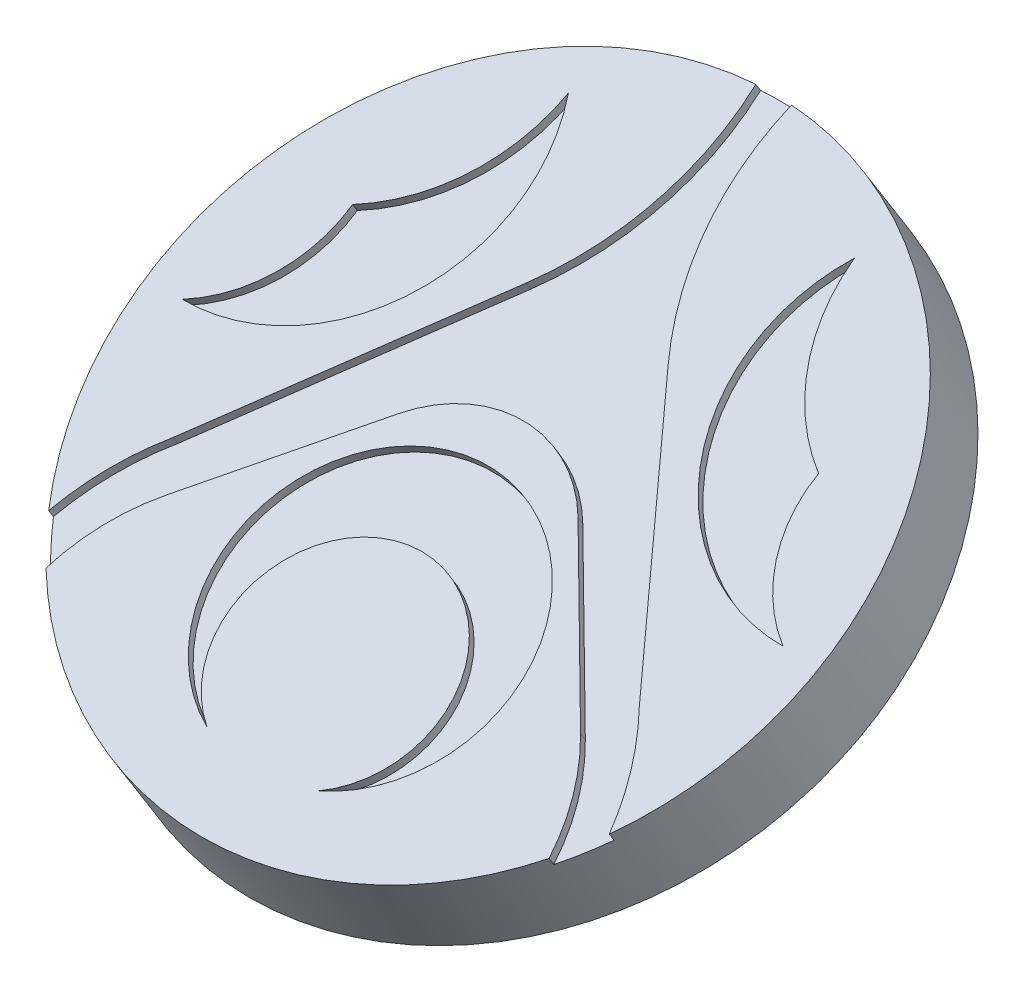
ISO-10303-21;
HEADER;
FILE_DESCRIPTION(('STEP AP214'),'2;1');
FILE_NAME('part.step','',(''),(''),'','','');
FILE_SCHEMA(('AUTOMOTIVE_DESIGN { 1 0 10303 214 1 1 1 1 }'));
ENDSEC;
DATA;
#1=APPLICATION_CONTEXT('core data for automotive mechanical design processes');
#2=APPLICATION_PROTOCOL_DEFINITION('international standard','automotive_design',2000,#1);
#3=PRODUCT_CONTEXT('',#1,'mechanical');
#4=PRODUCT('Part','Part','',(#3));
#5=PRODUCT_RELATED_PRODUCT_CATEGORY('part','',(#4));
#6=PRODUCT_DEFINITION_FORMATION('','',#4);
#7=PRODUCT_DEFINITION_CONTEXT('part definition',#1,'design');
#8=PRODUCT_DEFINITION('design','',#6,#7);
#9=PRODUCT_DEFINITION_SHAPE('','',#8);
#10=(LENGTH_UNIT() NAMED_UNIT(*) SI_UNIT(.MILLI.,.METRE.));
#11=(NAMED_UNIT(*) PLANE_ANGLE_UNIT() SI_UNIT($,.RADIAN.));
#12=(NAMED_UNIT(*) SI_UNIT($,.STERADIAN.) SOLID_ANGLE_UNIT());
#13=UNCERTAINTY_MEASURE_WITH_UNIT(LENGTH_MEASURE(1.E-05),#10,'distance_accuracy_value','');
#14=(GEOMETRIC_REPRESENTATION_CONTEXT(3) GLOBAL_UNCERTAINTY_ASSIGNED_CONTEXT((#13)) GLOBAL_UNIT_ASSIGNED_CONTEXT((#10,
#11,#12)) REPRESENTATION_CONTEXT('',''));
#15=CARTESIAN_POINT('',(0.,0.,0.));
#16=DIRECTION('',(0.,0.,1.));
#17=DIRECTION('',(1.,0.,0.));
#18=AXIS2_PLACEMENT_3D('',#15,#16,#17);
#19=CARTESIAN_POINT('',(0.,30.4440953354752,314.365678670782));
#20=DIRECTION('',(0.,0.847998304005088,0.52999894000318));
#21=DIRECTION('',(0.,-0.52999894000318,0.847998304005088));
#22=AXIS2_PLACEMENT_3D('',#19,#20,#21);
#23=PLANE('',#22);
#24=CARTESIAN_POINT('',(0.,30.4440953354752,314.365678670782));
#25=DIRECTION('',(0.,0.847998304005088,0.52999894000318));
#26=DIRECTION('',(0.,-0.52999894000318,0.847998304005088));
#27=AXIS2_PLACEMENT_3D('',#24,#25,#26);
#28=CIRCLE('',#27,9.525);
#29=CARTESIAN_POINT('',(-7.1025735942396,27.0804148447964,319.747567455869));
#30=VERTEX_POINT('',#29);
#31=CARTESIAN_POINT('',(7.1025735942396,27.0804148447964,319.747567455869));
#32=VERTEX_POINT('',#31);
#33=EDGE_CURVE('E313',#30,#32,#28,.T.);
#34=ORIENTED_EDGE('',*,*,#33,.T.);
#35=CARTESIAN_POINT('',(1.56426426695402,26.4598966904854,320.740396502766));
#36=DIRECTION('',(0.,0.847998304005088,0.52999894000318));
#37=DIRECTION('',(0.,-0.52999894000318,0.847998304005088));
#38=AXIS2_PLACEMENT_3D('',#35,#36,#37);
#39=CIRCLE('',#38,5.66070865712868);
#40=CARTESIAN_POINT('',(5.84199999999999,28.4247993740631,317.596552209042));
#41=VERTEX_POINT('',#40);
#42=EDGE_CURVE('E581',#32,#41,#39,.T.);
#43=ORIENTED_EDGE('',*,*,#42,.T.);
#44=DIRECTION('',(0.654930538417834,-0.400514412850582,0.640823060560932));
#45=VECTOR('',#44,1.);
#46=CARTESIAN_POINT('',(-122.50130380241,106.911508956891,192.017816876517));
#47=LINE('',#46,#45);
#48=CARTESIAN_POINT('',(2.54000000000001,30.4440953354752,314.365678670783));
#49=VERTEX_POINT('',#48);
#50=EDGE_CURVE('E578',#49,#41,#47,.T.);
#51=ORIENTED_EDGE('',*,*,#50,.F.);
#52=CARTESIAN_POINT('',(0.,29.2773910022149,316.232405603999));
#53=DIRECTION('',(0.,0.847998304005088,0.52999894000318));
#54=DIRECTION('',(0.,-0.52999894000318,0.847998304005088));
#55=AXIS2_PLACEMENT_3D('',#52,#53,#54);
#56=CIRCLE('',#55,3.36117069552328);
#57=CARTESIAN_POINT('',(-2.54,30.4440953354752,314.365678670783));
#58=VERTEX_POINT('',#57);
#59=EDGE_CURVE('E575',#58,#49,#56,.F.);
#60=ORIENTED_EDGE('',*,*,#59,.F.);
#61=DIRECTION('',(0.654930538417834,0.400514412850582,-0.640823060560932));
#62=VECTOR('',#61,1.);
#63=CARTESIAN_POINT('',(122.50130380241,106.911508956891,192.017816876517));
#64=LINE('',#63,#62);
#65=CARTESIAN_POINT('',(-5.842,28.4247993740631,317.596552209042));
#66=VERTEX_POINT('',#65);
#67=EDGE_CURVE('E572',#66,#58,#64,.T.);
#68=ORIENTED_EDGE('',*,*,#67,.F.);
#69=CARTESIAN_POINT('',(-1.56426426695402,26.4598966904854,320.740396502766));
#70=DIRECTION('',(0.,0.847998304005088,0.52999894000318));
#71=DIRECTION('',(0.,-0.52999894000318,0.847998304005088));
#72=AXIS2_PLACEMENT_3D('',#69,#70,#71);
#73=CIRCLE('',#72,5.66070865712868);
#74=EDGE_CURVE('E569',#30,#66,#73,.F.);
#75=ORIENTED_EDGE('',*,*,#74,.F.);
#76=EDGE_LOOP('',(#34,#43,#51,#60,#68,#75));
#77=FACE_BOUND('',#76,.T.);
#78=CARTESIAN_POINT('',(0.,27.7466670541809,318.681563920853));
#79=DIRECTION('',(0.,0.847998304005088,0.52999894000318));
#80=DIRECTION('',(0.,-0.52999894000318,0.847998304005088));
#81=AXIS2_PLACEMENT_3D('',#78,#79,#80);
#82=CIRCLE('',#81,2.88816416882768);
#83=CARTESIAN_POINT('',(-1.56426426695403,26.4598966904853,320.740396502766));
#84=VERTEX_POINT('',#83);
#85=CARTESIAN_POINT('',(1.56426426695403,26.4598966904855,320.740396502766));
#86=VERTEX_POINT('',#85);
#87=EDGE_CURVE('E466',#84,#86,#82,.F.);
#88=ORIENTED_EDGE('',*,*,#87,.F.);
#89=CARTESIAN_POINT('',(0.,28.3657380352231,317.691050351186));
#90=DIRECTION('',(0.,0.847998304005088,0.52999894000318));
#91=DIRECTION('',(0.,-0.52999894000318,0.847998304005088));
#92=AXIS2_PLACEMENT_3D('',#89,#90,#91);
#93=CIRCLE('',#92,3.92143671124991);
#94=EDGE_CURVE('E320',#84,#86,#93,.F.);
#95=ORIENTED_EDGE('',*,*,#94,.T.);
#96=EDGE_LOOP('',(#88,#95));
#97=FACE_BOUND('',#96,.T.);
#98=ADVANCED_FACE('F303',(#77,#97),#23,.T.);
#99=CARTESIAN_POINT('',(-0.503720012659657,35.4852710485308,306.299797529894));
#100=VERTEX_POINT('',#99);
#101=CARTESIAN_POINT('',(-7.91552356403314,27.6360955421862,318.858478340045));
#102=VERTEX_POINT('',#101);
#103=EDGE_CURVE('E312',#100,#102,#28,.T.);
#104=ORIENTED_EDGE('',*,*,#103,.T.);
#105=CARTESIAN_POINT('',(-0.951911148515844,26.5879265760419,320.535548685876));
#106=DIRECTION('',(0.,0.847998304005088,0.52999894000318));
#107=DIRECTION('',(0.,-0.52999894000318,0.847998304005088));
#108=AXIS2_PLACEMENT_3D('',#105,#106,#107);
#109=CIRCLE('',#108,7.239);
#110=CARTESIAN_POINT('',(-6.57894839811803,29.0015799675352,316.673703259487));
#111=VERTEX_POINT('',#110);
#112=EDGE_CURVE('E566',#102,#111,#109,.F.);
#113=ORIENTED_EDGE('',*,*,#112,.T.);
#114=DIRECTION('',(0.584304725845072,0.430112340745472,-0.688179745192756));
#115=VECTOR('',#114,1.);
#116=CARTESIAN_POINT('',(115.715213637308,119.023491422193,172.638644932034));
#117=LINE('',#116,#115);
#118=CARTESIAN_POINT('',(-2.00694839811805,32.3670732365554,311.288914029054));
#119=VERTEX_POINT('',#118);
#120=EDGE_CURVE('E563',#111,#119,#117,.T.);
#121=ORIENTED_EDGE('',*,*,#120,.T.);
#122=CARTESIAN_POINT('',(-8.75347840553545,34.9415439384496,307.169760906024));
#123=DIRECTION('',(0.,0.847998304005088,0.52999894000318));
#124=DIRECTION('',(0.,-0.52999894000318,0.847998304005088));
#125=AXIS2_PLACEMENT_3D('',#122,#123,#124);
#126=CIRCLE('',#125,8.31330193045273);
#127=EDGE_CURVE('E560',#119,#100,#126,.T.);
#128=ORIENTED_EDGE('',*,*,#127,.T.);
#129=EDGE_LOOP('',(#104,#113,#121,#128));
#130=FACE_BOUND('',#129,.T.);
#131=CARTESIAN_POINT('',(-9.11456719373617,34.4981648602416,307.879167431156));
#132=DIRECTION('',(0.,0.847998304005088,0.52999894000318));
#133=DIRECTION('',(0.,-0.52999894000318,0.847998304005088));
#134=AXIS2_PLACEMENT_3D('',#131,#132,#133);
#135=CIRCLE('',#134,5.08000000000002);
#136=CARTESIAN_POINT('',(-6.57894839811804,32.1651436404141,311.61200138288));
#137=VERTEX_POINT('',#136);
#138=CARTESIAN_POINT('',(-4.038948398118,34.3863691979674,308.058040490795));
#139=VERTEX_POINT('',#138);
#140=EDGE_CURVE('E508',#137,#139,#135,.T.);
#141=ORIENTED_EDGE('',*,*,#140,.T.);
#142=CARTESIAN_POINT('',(-8.4382387100627,33.0400628953536,310.212130574977));
#143=DIRECTION('',(0.,0.847998304005088,0.52999894000318));
#144=DIRECTION('',(0.,-0.52999894000318,0.847998304005088));
#145=AXIS2_PLACEMENT_3D('',#142,#143,#144);
#146=CIRCLE('',#145,5.08000000000001);
#147=CARTESIAN_POINT('',(-8.48394839811804,30.3477772751432,314.519787567314));
#148=VERTEX_POINT('',#147);
#149=EDGE_CURVE('E493',#139,#148,#146,.F.);
#150=ORIENTED_EDGE('',*,*,#149,.T.);
#151=CARTESIAN_POINT('',(-10.3867909799169,32.0971985365006,311.720713549142));
#152=DIRECTION('',(0.,0.847998304005088,0.52999894000318));
#153=DIRECTION('',(0.,-0.52999894000318,0.847998304005088));
#154=AXIS2_PLACEMENT_3D('',#151,#152,#153);
#155=CIRCLE('',#154,3.81000000000002);
#156=EDGE_CURVE('E501',#148,#137,#155,.T.);
#157=ORIENTED_EDGE('',*,*,#156,.T.);
#158=EDGE_LOOP('',(#141,#150,#157));
#159=FACE_BOUND('',#158,.T.);
#160=ADVANCED_FACE('F635',(#130,#159),#23,.T.);
#161=CARTESIAN_POINT('',(0.,9.17300933594134,301.071249921074));
#162=DIRECTION('',(0.,0.847998304005088,0.52999894000318));
#163=DIRECTION('',(0.,-0.52999894000318,0.847998304005088));
#164=AXIS2_PLACEMENT_3D('',#161,#162,#163);
#165=CYLINDRICAL_SURFACE('',#164,9.525);
#166=DIRECTION('',(0.,0.847998304005088,0.52999894000318));
#167=VECTOR('',#166,1.);
#168=CARTESIAN_POINT('',(-7.1025735942396,26.8650232755791,319.612947725108));
#169=LINE('',#168,#167);
#170=CARTESIAN_POINT('',(-7.1025735942396,26.8650232755791,319.612947725108));
#171=VERTEX_POINT('',#170);
#172=EDGE_CURVE('E601',#171,#30,#169,.T.);
#173=ORIENTED_EDGE('',*,*,#172,.F.);
#174=CARTESIAN_POINT('',(0.,30.228703766258,314.231058940022));
#175=DIRECTION('',(0.,0.847998304005088,0.52999894000318));
#176=DIRECTION('',(0.,-0.52999894000318,0.847998304005088));
#177=AXIS2_PLACEMENT_3D('',#174,#175,#176);
#178=CIRCLE('',#177,9.525);
#179=CARTESIAN_POINT('',(-7.91552356403314,27.4207039729689,318.723858609284));
#180=VERTEX_POINT('',#179);
#181=EDGE_CURVE('E533',#180,#171,#178,.T.);
#182=ORIENTED_EDGE('',*,*,#181,.F.);
#183=DIRECTION('',(0.,0.847998304005088,0.52999894000318));
#184=VECTOR('',#183,1.);
#185=CARTESIAN_POINT('',(-7.91552356403314,27.4207039729689,318.723858609284));
#186=LINE('',#185,#184);
#187=EDGE_CURVE('E603',#180,#102,#186,.T.);
#188=ORIENTED_EDGE('',*,*,#187,.T.);
#189=ORIENTED_EDGE('',*,*,#103,.F.);
#190=DIRECTION('',(0.,0.847998304005088,0.52999894000318));
#191=VECTOR('',#190,1.);
#192=CARTESIAN_POINT('',(-0.503720012659657,35.2698794793135,306.165177799133));
#193=LINE('',#192,#191);
#194=CARTESIAN_POINT('',(-0.503720012659657,35.2698794793135,306.165177799133));
#195=VERTEX_POINT('',#194);
#196=EDGE_CURVE('E610',#195,#100,#193,.T.);
#197=ORIENTED_EDGE('',*,*,#196,.F.);
#198=CARTESIAN_POINT('',(0.503720012659657,35.2698794793135,306.165177799133));
#199=VERTEX_POINT('',#198);
#200=EDGE_CURVE('E528',#199,#195,#178,.T.);
#201=ORIENTED_EDGE('',*,*,#200,.F.);
#202=DIRECTION('',(0.,0.847998304005088,0.52999894000318));
#203=VECTOR('',#202,1.);
#204=CARTESIAN_POINT('',(0.503720012659657,35.2698794793135,306.165177799133));
#205=LINE('',#204,#203);
#206=CARTESIAN_POINT('',(0.503720012659657,35.4852710485308,306.299797529894));
#207=VERTEX_POINT('',#206);
#208=EDGE_CURVE('E612',#199,#207,#205,.T.);
#209=ORIENTED_EDGE('',*,*,#208,.T.);
#210=CARTESIAN_POINT('',(7.91552356403314,27.6360955421862,318.858478340045));
#211=VERTEX_POINT('',#210);
#212=EDGE_CURVE('E12',#211,#207,#28,.T.);
#213=ORIENTED_EDGE('',*,*,#212,.F.);
#214=DIRECTION('',(0.,0.847998304005088,0.52999894000318));
#215=VECTOR('',#214,1.);
#216=CARTESIAN_POINT('',(7.91552356403314,27.4207039729689,318.723858609284));
#217=LINE('',#216,#215);
#218=CARTESIAN_POINT('',(7.91552356403314,27.4207039729689,318.723858609284));
#219=VERTEX_POINT('',#218);
#220=EDGE_CURVE('E588',#219,#211,#217,.T.);
#221=ORIENTED_EDGE('',*,*,#220,.F.);
#222=CARTESIAN_POINT('',(7.1025735942396,26.8650232755791,319.612947725108));
#223=VERTEX_POINT('',#222);
#224=EDGE_CURVE('E532',#223,#219,#178,.T.);
#225=ORIENTED_EDGE('',*,*,#224,.F.);
#226=DIRECTION('',(0.,0.847998304005088,0.52999894000318));
#227=VECTOR('',#226,1.);
#228=CARTESIAN_POINT('',(7.1025735942396,26.8650232755791,319.612947725108));
#229=LINE('',#228,#227);
#230=EDGE_CURVE('E590',#223,#32,#229,.T.);
#231=ORIENTED_EDGE('',*,*,#230,.T.);
#232=ORIENTED_EDGE('',*,*,#33,.F.);
#233=EDGE_LOOP('',(#173,#182,#188,#189,#197,#201,#209,#213,#221,#225,#231,#232));
#234=FACE_BOUND('',#233,.T.);
#235=CARTESIAN_POINT('',(0.,28.2901796433022,313.019481363174));
#236=DIRECTION('',(0.,0.847998304005088,0.52999894000318));
#237=DIRECTION('',(0.,-0.52999894000318,0.847998304005088));
#238=AXIS2_PLACEMENT_3D('',#235,#236,#237);
#239=CIRCLE('',#238,9.525);
#240=CARTESIAN_POINT('',(0.,23.2419397397719,321.096665208823));
#241=VERTEX_POINT('',#240);
#242=EDGE_CURVE('E307',#241,#241,#239,.T.);
#243=ORIENTED_EDGE('',*,*,#242,.T.);
#244=EDGE_LOOP('',(#243));
#245=FACE_BOUND('',#244,.T.);
#246=ADVANCED_FACE('F305',(#234,#245),#165,.T.);
#247=CARTESIAN_POINT('',(0.,28.2901796433022,313.019481363174));
#248=DIRECTION('',(0.,0.847998304005088,0.52999894000318));
#249=DIRECTION('',(0.,-0.52999894000318,0.847998304005088));
#250=AXIS2_PLACEMENT_3D('',#247,#248,#249);
#251=PLANE('',#250);
#252=ORIENTED_EDGE('',*,*,#242,.F.);
#253=EDGE_LOOP('',(#252));
#254=FACE_BOUND('',#253,.T.);
#255=ADVANCED_FACE('F625',(#254),#251,.F.);
#256=CARTESIAN_POINT('',(10.3867909799169,32.0971985365006,311.720713549142));
#257=DIRECTION('',(0.,0.847998304005088,0.52999894000318));
#258=DIRECTION('',(0.,-0.52999894000318,0.847998304005088));
#259=AXIS2_PLACEMENT_3D('',#256,#257,#258);
#260=CIRCLE('',#259,3.81000000000002);
#261=CARTESIAN_POINT('',(8.48394839811802,30.3477772751432,314.519787567314));
#262=VERTEX_POINT('',#261);
#263=CARTESIAN_POINT('',(6.57894839811801,32.165143640414,311.61200138288));
#264=VERTEX_POINT('',#263);
#265=EDGE_CURVE('E328',#262,#264,#260,.F.);
#266=ORIENTED_EDGE('',*,*,#265,.F.);
#267=CARTESIAN_POINT('',(8.4382387100627,33.0400628953536,310.212130574977));
#268=DIRECTION('',(0.,0.847998304005088,0.52999894000318));
#269=DIRECTION('',(0.,-0.52999894000318,0.847998304005088));
#270=AXIS2_PLACEMENT_3D('',#267,#268,#269);
#271=CIRCLE('',#270,5.08000000000001);
#272=CARTESIAN_POINT('',(4.03894839811803,34.3863691979675,308.058040490795));
#273=VERTEX_POINT('',#272);
#274=EDGE_CURVE('E478',#273,#262,#271,.T.);
#275=ORIENTED_EDGE('',*,*,#274,.F.);
#276=CARTESIAN_POINT('',(9.11456719373617,34.4981648602416,307.879167431156));
#277=DIRECTION('',(0.,0.847998304005088,0.52999894000318));
#278=DIRECTION('',(0.,-0.52999894000318,0.847998304005088));
#279=AXIS2_PLACEMENT_3D('',#276,#277,#278);
#280=CIRCLE('',#279,5.08000000000002);
#281=EDGE_CURVE('E486',#264,#273,#280,.F.);
#282=ORIENTED_EDGE('',*,*,#281,.F.);
#283=EDGE_LOOP('',(#266,#275,#282));
#284=FACE_BOUND('',#283,.T.);
#285=CARTESIAN_POINT('',(0.951911148515844,26.5879265760419,320.535548685876));
#286=DIRECTION('',(0.,0.847998304005088,0.52999894000318));
#287=DIRECTION('',(0.,-0.52999894000318,0.847998304005088));
#288=AXIS2_PLACEMENT_3D('',#285,#286,#287);
#289=CIRCLE('',#288,7.239);
#290=CARTESIAN_POINT('',(6.57894839811803,29.0015799675352,316.673703259487));
#291=VERTEX_POINT('',#290);
#292=EDGE_CURVE('E525',#211,#291,#289,.T.);
#293=ORIENTED_EDGE('',*,*,#292,.F.);
#294=ORIENTED_EDGE('',*,*,#212,.T.);
#295=CARTESIAN_POINT('',(8.75347840553545,34.9415439384496,307.169760906024));
#296=DIRECTION('',(0.,0.847998304005088,0.52999894000318));
#297=DIRECTION('',(0.,-0.52999894000318,0.847998304005088));
#298=AXIS2_PLACEMENT_3D('',#295,#296,#297);
#299=CIRCLE('',#298,8.31330193045273);
#300=CARTESIAN_POINT('',(2.00694839811799,32.3670732365553,311.288914029054));
#301=VERTEX_POINT('',#300);
#302=EDGE_CURVE('E558',#301,#207,#299,.F.);
#303=ORIENTED_EDGE('',*,*,#302,.F.);
#304=DIRECTION('',(-0.584304725845072,0.430112340745472,-0.688179745192756));
#305=VECTOR('',#304,1.);
#306=CARTESIAN_POINT('',(-115.715213637308,119.023491422193,172.638644932034));
#307=LINE('',#306,#305);
#308=EDGE_CURVE('E516',#291,#301,#307,.T.);
#309=ORIENTED_EDGE('',*,*,#308,.F.);
#310=EDGE_LOOP('',(#293,#294,#303,#309));
#311=FACE_BOUND('',#310,.T.);
#312=ADVANCED_FACE('F627',(#284,#311),#23,.T.);
#313=CARTESIAN_POINT('',(-115.715213637308,118.808099852976,172.504025201273));
#314=DIRECTION('',(0.811534341451497,0.309680885336737,-0.495489416538779));
#315=DIRECTION('',(-0.521106737780651,0.,-0.853491515974007));
#316=AXIS2_PLACEMENT_3D('',#313,#314,#315);
#317=PLANE('',#316);
#318=ORIENTED_EDGE('',*,*,#308,.T.);
#319=DIRECTION('',(0.,0.847998304005088,0.52999894000318));
#320=VECTOR('',#319,1.);
#321=CARTESIAN_POINT('',(2.00694839811805,32.1516816673381,311.154294298293));
#322=LINE('',#321,#320);
#323=CARTESIAN_POINT('',(2.00694839811805,32.1516816673381,311.154294298293));
#324=VERTEX_POINT('',#323);
#325=EDGE_CURVE('E556',#324,#301,#322,.T.);
#326=ORIENTED_EDGE('',*,*,#325,.F.);
#327=DIRECTION('',(-0.584304725845072,0.430112340745472,-0.688179745192756));
#328=VECTOR('',#327,1.);
#329=CARTESIAN_POINT('',(-115.715213637308,118.808099852976,172.504025201273));
#330=LINE('',#329,#328);
#331=CARTESIAN_POINT('',(6.57894839811803,28.7861883983179,316.539083528726));
#332=VERTEX_POINT('',#331);
#333=EDGE_CURVE('E521',#332,#324,#330,.T.);
#334=ORIENTED_EDGE('',*,*,#333,.F.);
#335=DIRECTION('',(0.,0.847998304005088,0.52999894000318));
#336=VECTOR('',#335,1.);
#337=CARTESIAN_POINT('',(6.57894839811803,28.7861883983179,316.539083528726));
#338=LINE('',#337,#336);
#339=EDGE_CURVE('E586',#332,#291,#338,.T.);
#340=ORIENTED_EDGE('',*,*,#339,.T.);
#341=EDGE_LOOP('',(#318,#326,#334,#340));
#342=FACE_BOUND('',#341,.T.);
#343=ADVANCED_FACE('F633',(#342),#317,.F.);
#344=CARTESIAN_POINT('',(0.951911148515844,26.3725350068246,320.400928955115));
#345=DIRECTION('',(0.,0.847998304005088,0.52999894000318));
#346=DIRECTION('',(0.,-0.52999894000318,0.847998304005088));
#347=AXIS2_PLACEMENT_3D('',#344,#345,#346);
#348=CYLINDRICAL_SURFACE('',#347,7.239);
#349=ORIENTED_EDGE('',*,*,#292,.T.);
#350=ORIENTED_EDGE('',*,*,#339,.F.);
#351=CARTESIAN_POINT('',(0.951911148515844,26.3725350068246,320.400928955115));
#352=DIRECTION('',(0.,0.847998304005088,0.52999894000318));
#353=DIRECTION('',(0.,-0.52999894000318,0.847998304005088));
#354=AXIS2_PLACEMENT_3D('',#351,#352,#353);
#355=CIRCLE('',#354,7.239);
#356=EDGE_CURVE('E553',#219,#332,#355,.T.);
#357=ORIENTED_EDGE('',*,*,#356,.F.);
#358=ORIENTED_EDGE('',*,*,#220,.T.);
#359=EDGE_LOOP('',(#349,#350,#357,#358));
#360=FACE_BOUND('',#359,.T.);
#361=ADVANCED_FACE('F678',(#360),#348,.F.);
#362=CARTESIAN_POINT('',(1.56426426695402,26.2445051212681,320.605776772005));
#363=DIRECTION('',(0.,0.847998304005088,0.52999894000318));
#364=DIRECTION('',(0.,-0.52999894000318,0.847998304005088));
#365=AXIS2_PLACEMENT_3D('',#362,#363,#364);
#366=CYLINDRICAL_SURFACE('',#365,5.66070865712868);
#367=ORIENTED_EDGE('',*,*,#42,.F.);
#368=ORIENTED_EDGE('',*,*,#230,.F.);
#369=CARTESIAN_POINT('',(1.56426426695402,26.2445051212681,320.605776772005));
#370=DIRECTION('',(0.,0.847998304005088,0.52999894000318));
#371=DIRECTION('',(0.,-0.52999894000318,0.847998304005088));
#372=AXIS2_PLACEMENT_3D('',#369,#370,#371);
#373=CIRCLE('',#372,5.66070865712868);
#374=CARTESIAN_POINT('',(5.84199999999999,28.2094078048458,317.461932478281));
#375=VERTEX_POINT('',#374);
#376=EDGE_CURVE('E551',#223,#375,#373,.T.);
#377=ORIENTED_EDGE('',*,*,#376,.T.);
#378=DIRECTION('',(0.,0.847998304005088,0.52999894000318));
#379=VECTOR('',#378,1.);
#380=CARTESIAN_POINT('',(5.84199999999999,28.2094078048458,317.461932478281));
#381=LINE('',#380,#379);
#382=EDGE_CURVE('E593',#375,#41,#381,.T.);
#383=ORIENTED_EDGE('',*,*,#382,.T.);
#384=EDGE_LOOP('',(#367,#368,#377,#383));
#385=FACE_BOUND('',#384,.T.);
#386=ADVANCED_FACE('F681',(#385),#366,.T.);
#387=CARTESIAN_POINT('',(-122.50130380241,106.696117387674,191.883197145756));
#388=DIRECTION('',(-0.755689082789824,-0.347112491137164,0.555379985819462));
#389=DIRECTION('',(0.592200968940343,0.,0.805790302985907));
#390=AXIS2_PLACEMENT_3D('',#387,#388,#389);
#391=PLANE('',#390);
#392=ORIENTED_EDGE('',*,*,#50,.T.);
#393=ORIENTED_EDGE('',*,*,#382,.F.);
#394=DIRECTION('',(0.654930538417834,-0.400514412850582,0.640823060560932));
#395=VECTOR('',#394,1.);
#396=CARTESIAN_POINT('',(-122.50130380241,106.696117387674,191.883197145756));
#397=LINE('',#396,#395);
#398=CARTESIAN_POINT('',(2.54000000000001,30.2287037662579,314.231058940022));
#399=VERTEX_POINT('',#398);
#400=EDGE_CURVE('E548',#399,#375,#397,.T.);
#401=ORIENTED_EDGE('',*,*,#400,.F.);
#402=DIRECTION('',(0.,0.847998304005088,0.52999894000318));
#403=VECTOR('',#402,1.);
#404=CARTESIAN_POINT('',(2.54000000000001,30.2287037662579,314.231058940022));
#405=LINE('',#404,#403);
#406=EDGE_CURVE('E595',#399,#49,#405,.T.);
#407=ORIENTED_EDGE('',*,*,#406,.T.);
#408=EDGE_LOOP('',(#392,#393,#401,#407));
#409=FACE_BOUND('',#408,.T.);
#410=ADVANCED_FACE('F685',(#409),#391,.F.);
#411=CARTESIAN_POINT('',(0.,29.0619994329976,316.097785873238));
#412=DIRECTION('',(0.,0.847998304005088,0.52999894000318));
#413=DIRECTION('',(0.,-0.52999894000318,0.847998304005088));
#414=AXIS2_PLACEMENT_3D('',#411,#412,#413);
#415=CYLINDRICAL_SURFACE('',#414,3.36117069552328);
#416=ORIENTED_EDGE('',*,*,#59,.T.);
#417=ORIENTED_EDGE('',*,*,#406,.F.);
#418=CARTESIAN_POINT('',(0.,29.0619994329976,316.097785873238));
#419=DIRECTION('',(0.,0.847998304005088,0.52999894000318));
#420=DIRECTION('',(0.,-0.52999894000318,0.847998304005088));
#421=AXIS2_PLACEMENT_3D('',#418,#419,#420);
#422=CIRCLE('',#421,3.36117069552328);
#423=CARTESIAN_POINT('',(-2.54,30.2287037662579,314.231058940022));
#424=VERTEX_POINT('',#423);
#425=EDGE_CURVE('E545',#424,#399,#422,.F.);
#426=ORIENTED_EDGE('',*,*,#425,.F.);
#427=DIRECTION('',(0.,0.847998304005088,0.52999894000318));
#428=VECTOR('',#427,1.);
#429=CARTESIAN_POINT('',(-2.54,30.2287037662579,314.231058940022));
#430=LINE('',#429,#428);
#431=EDGE_CURVE('E597',#424,#58,#430,.T.);
#432=ORIENTED_EDGE('',*,*,#431,.T.);
#433=EDGE_LOOP('',(#416,#417,#426,#432));
#434=FACE_BOUND('',#433,.T.);
#435=ADVANCED_FACE('F689',(#434),#415,.T.);
#436=CARTESIAN_POINT('',(122.50130380241,106.696117387674,191.883197145756));
#437=DIRECTION('',(0.755689082789824,-0.347112491137164,0.555379985819462));
#438=DIRECTION('',(0.592200968940343,0.,-0.805790302985906));
#439=AXIS2_PLACEMENT_3D('',#436,#437,#438);
#440=PLANE('',#439);
#441=ORIENTED_EDGE('',*,*,#67,.T.);
#442=ORIENTED_EDGE('',*,*,#431,.F.);
#443=DIRECTION('',(0.654930538417834,0.400514412850582,-0.640823060560932));
#444=VECTOR('',#443,1.);
#445=CARTESIAN_POINT('',(122.50130380241,106.696117387674,191.883197145756));
#446=LINE('',#445,#444);
#447=CARTESIAN_POINT('',(-5.842,28.2094078048458,317.461932478281));
#448=VERTEX_POINT('',#447);
#449=EDGE_CURVE('E542',#448,#424,#446,.T.);
#450=ORIENTED_EDGE('',*,*,#449,.F.);
#451=DIRECTION('',(0.,0.847998304005088,0.52999894000318));
#452=VECTOR('',#451,1.);
#453=CARTESIAN_POINT('',(-5.842,28.2094078048458,317.461932478281));
#454=LINE('',#453,#452);
#455=EDGE_CURVE('E599',#448,#66,#454,.T.);
#456=ORIENTED_EDGE('',*,*,#455,.T.);
#457=EDGE_LOOP('',(#441,#442,#450,#456));
#458=FACE_BOUND('',#457,.T.);
#459=ADVANCED_FACE('F693',(#458),#440,.F.);
#460=CARTESIAN_POINT('',(-1.56426426695402,26.2445051212681,320.605776772005));
#461=DIRECTION('',(0.,0.847998304005088,0.52999894000318));
#462=DIRECTION('',(0.,-0.52999894000318,0.847998304005088));
#463=AXIS2_PLACEMENT_3D('',#460,#461,#462);
#464=CYLINDRICAL_SURFACE('',#463,5.66070865712868);
#465=ORIENTED_EDGE('',*,*,#74,.T.);
#466=ORIENTED_EDGE('',*,*,#455,.F.);
#467=CARTESIAN_POINT('',(-1.56426426695402,26.2445051212681,320.605776772005));
#468=DIRECTION('',(0.,0.847998304005088,0.52999894000318));
#469=DIRECTION('',(0.,-0.52999894000318,0.847998304005088));
#470=AXIS2_PLACEMENT_3D('',#467,#468,#469);
#471=CIRCLE('',#470,5.66070865712868);
#472=EDGE_CURVE('E539',#171,#448,#471,.F.);
#473=ORIENTED_EDGE('',*,*,#472,.F.);
#474=ORIENTED_EDGE('',*,*,#172,.T.);
#475=EDGE_LOOP('',(#465,#466,#473,#474));
#476=FACE_BOUND('',#475,.T.);
#477=ADVANCED_FACE('F697',(#476),#464,.T.);
#478=CARTESIAN_POINT('',(-0.951911148515844,26.3725350068246,320.400928955115));
#479=DIRECTION('',(0.,0.847998304005088,0.52999894000318));
#480=DIRECTION('',(0.,-0.52999894000318,0.847998304005088));
#481=AXIS2_PLACEMENT_3D('',#478,#479,#480);
#482=CYLINDRICAL_SURFACE('',#481,7.239);
#483=ORIENTED_EDGE('',*,*,#112,.F.);
#484=ORIENTED_EDGE('',*,*,#187,.F.);
#485=CARTESIAN_POINT('',(-0.951911148515844,26.3725350068246,320.400928955115));
#486=DIRECTION('',(0.,0.847998304005088,0.52999894000318));
#487=DIRECTION('',(0.,-0.52999894000318,0.847998304005088));
#488=AXIS2_PLACEMENT_3D('',#485,#486,#487);
#489=CIRCLE('',#488,7.239);
#490=CARTESIAN_POINT('',(-6.57894839811803,28.7861883983179,316.539083528726));
#491=VERTEX_POINT('',#490);
#492=EDGE_CURVE('E537',#180,#491,#489,.F.);
#493=ORIENTED_EDGE('',*,*,#492,.T.);
#494=DIRECTION('',(0.,0.847998304005088,0.52999894000318));
#495=VECTOR('',#494,1.);
#496=CARTESIAN_POINT('',(-6.57894839811803,28.7861883983179,316.539083528726));
#497=LINE('',#496,#495);
#498=EDGE_CURVE('E606',#491,#111,#497,.T.);
#499=ORIENTED_EDGE('',*,*,#498,.T.);
#500=EDGE_LOOP('',(#483,#484,#493,#499));
#501=FACE_BOUND('',#500,.T.);
#502=ADVANCED_FACE('F701',(#501),#482,.F.);
#503=CARTESIAN_POINT('',(115.715213637308,118.808099852976,172.504025201273));
#504=DIRECTION('',(0.811534341451497,-0.309680885336737,0.495489416538779));
#505=DIRECTION('',(0.521106737780651,0.,-0.853491515974007));
#506=AXIS2_PLACEMENT_3D('',#503,#504,#505);
#507=PLANE('',#506);
#508=ORIENTED_EDGE('',*,*,#120,.F.);
#509=ORIENTED_EDGE('',*,*,#498,.F.);
#510=DIRECTION('',(0.584304725845072,0.430112340745472,-0.688179745192756));
#511=VECTOR('',#510,1.);
#512=CARTESIAN_POINT('',(115.715213637308,118.808099852976,172.504025201273));
#513=LINE('',#512,#511);
#514=CARTESIAN_POINT('',(-2.00694839811805,32.1516816673381,311.154294298294));
#515=VERTEX_POINT('',#514);
#516=EDGE_CURVE('E535',#491,#515,#513,.T.);
#517=ORIENTED_EDGE('',*,*,#516,.T.);
#518=DIRECTION('',(0.,0.847998304005088,0.52999894000318));
#519=VECTOR('',#518,1.);
#520=CARTESIAN_POINT('',(-2.00694839811805,32.1516816673381,311.154294298294));
#521=LINE('',#520,#519);
#522=EDGE_CURVE('E608',#515,#119,#521,.T.);
#523=ORIENTED_EDGE('',*,*,#522,.T.);
#524=EDGE_LOOP('',(#508,#509,#517,#523));
#525=FACE_BOUND('',#524,.T.);
#526=ADVANCED_FACE('F705',(#525),#507,.T.);
#527=CARTESIAN_POINT('',(-8.75347840553545,34.7261523692323,307.035141175263));
#528=DIRECTION('',(0.,0.847998304005088,0.52999894000318));
#529=DIRECTION('',(0.,-0.52999894000318,0.847998304005088));
#530=AXIS2_PLACEMENT_3D('',#527,#528,#529);
#531=CYLINDRICAL_SURFACE('',#530,8.31330193045273);
#532=ORIENTED_EDGE('',*,*,#127,.F.);
#533=ORIENTED_EDGE('',*,*,#522,.F.);
#534=CARTESIAN_POINT('',(-8.75347840553545,34.7261523692323,307.035141175263));
#535=DIRECTION('',(0.,0.847998304005088,0.52999894000318));
#536=DIRECTION('',(0.,-0.52999894000318,0.847998304005088));
#537=AXIS2_PLACEMENT_3D('',#534,#535,#536);
#538=CIRCLE('',#537,8.31330193045273);
#539=EDGE_CURVE('E531',#515,#195,#538,.T.);
#540=ORIENTED_EDGE('',*,*,#539,.T.);
#541=ORIENTED_EDGE('',*,*,#196,.T.);
#542=EDGE_LOOP('',(#532,#533,#540,#541));
#543=FACE_BOUND('',#542,.T.);
#544=ADVANCED_FACE('F709',(#543),#531,.T.);
#545=CARTESIAN_POINT('',(8.75347840553545,34.7261523692323,307.035141175263));
#546=DIRECTION('',(0.,0.847998304005088,0.52999894000318));
#547=DIRECTION('',(0.,-0.52999894000318,0.847998304005088));
#548=AXIS2_PLACEMENT_3D('',#545,#546,#547);
#549=CYLINDRICAL_SURFACE('',#548,8.31330193045273);
#550=ORIENTED_EDGE('',*,*,#302,.T.);
#551=ORIENTED_EDGE('',*,*,#208,.F.);
#552=CARTESIAN_POINT('',(8.75347840553545,34.7261523692323,307.035141175263));
#553=DIRECTION('',(0.,0.847998304005088,0.52999894000318));
#554=DIRECTION('',(0.,-0.52999894000318,0.847998304005088));
#555=AXIS2_PLACEMENT_3D('',#552,#553,#554);
#556=CIRCLE('',#555,8.31330193045273);
#557=EDGE_CURVE('E524',#324,#199,#556,.F.);
#558=ORIENTED_EDGE('',*,*,#557,.F.);
#559=ORIENTED_EDGE('',*,*,#325,.T.);
#560=EDGE_LOOP('',(#550,#551,#558,#559));
#561=FACE_BOUND('',#560,.T.);
#562=ADVANCED_FACE('F676',(#561),#549,.T.);
#563=CARTESIAN_POINT('',(0.,162.964937063386,101.853085664616));
#564=DIRECTION('',(0.,0.847998304005088,0.52999894000318));
#565=DIRECTION('',(0.,-0.52999894000318,0.847998304005088));
#566=AXIS2_PLACEMENT_3D('',#563,#564,#565);
#567=PLANE('',#566);
#568=ORIENTED_EDGE('',*,*,#333,.T.);
#569=ORIENTED_EDGE('',*,*,#557,.T.);
#570=ORIENTED_EDGE('',*,*,#200,.T.);
#571=ORIENTED_EDGE('',*,*,#539,.F.);
#572=ORIENTED_EDGE('',*,*,#516,.F.);
#573=ORIENTED_EDGE('',*,*,#492,.F.);
#574=ORIENTED_EDGE('',*,*,#181,.T.);
#575=ORIENTED_EDGE('',*,*,#472,.T.);
#576=ORIENTED_EDGE('',*,*,#449,.T.);
#577=ORIENTED_EDGE('',*,*,#425,.T.);
#578=ORIENTED_EDGE('',*,*,#400,.T.);
#579=ORIENTED_EDGE('',*,*,#376,.F.);
#580=ORIENTED_EDGE('',*,*,#224,.T.);
#581=ORIENTED_EDGE('',*,*,#356,.T.);
#582=EDGE_LOOP('',(#568,#569,#570,#571,#572,#573,#574,#575,#576,#577,#578,#579,#580,#581));
#583=FACE_BOUND('',#582,.T.);
#584=ADVANCED_FACE('F669',(#583),#567,.T.);
#585=CARTESIAN_POINT('',(-8.4382387100627,32.8246713261363,310.077510844216));
#586=DIRECTION('',(0.,0.847998304005088,0.52999894000318));
#587=DIRECTION('',(0.,-0.52999894000318,0.847998304005088));
#588=AXIS2_PLACEMENT_3D('',#585,#586,#587);
#589=CYLINDRICAL_SURFACE('',#588,5.08000000000001);
#590=ORIENTED_EDGE('',*,*,#149,.F.);
#591=DIRECTION('',(0.,0.847998304005088,0.52999894000318));
#592=VECTOR('',#591,1.);
#593=CARTESIAN_POINT('',(-4.038948398118,34.1709776287502,307.923420760034));
#594=LINE('',#593,#592);
#595=CARTESIAN_POINT('',(-4.038948398118,34.1709776287502,307.923420760034));
#596=VERTEX_POINT('',#595);
#597=EDGE_CURVE('E505',#596,#139,#594,.T.);
#598=ORIENTED_EDGE('',*,*,#597,.F.);
#599=CARTESIAN_POINT('',(-8.4382387100627,32.8246713261363,310.077510844216));
#600=DIRECTION('',(0.,0.847998304005088,0.52999894000318));
#601=DIRECTION('',(0.,-0.52999894000318,0.847998304005088));
#602=AXIS2_PLACEMENT_3D('',#599,#600,#601);
#603=CIRCLE('',#602,5.08000000000001);
#604=CARTESIAN_POINT('',(-8.48394839811804,30.1323857059259,314.385167836553));
#605=VERTEX_POINT('',#604);
#606=EDGE_CURVE('E497',#596,#605,#603,.F.);
#607=ORIENTED_EDGE('',*,*,#606,.T.);
#608=DIRECTION('',(0.,0.847998304005088,0.52999894000318));
#609=VECTOR('',#608,1.);
#610=CARTESIAN_POINT('',(-8.48394839811804,30.1323857059259,314.385167836553));
#611=LINE('',#610,#609);
#612=EDGE_CURVE('E513',#605,#148,#611,.T.);
#613=ORIENTED_EDGE('',*,*,#612,.T.);
#614=EDGE_LOOP('',(#590,#598,#607,#613));
#615=FACE_BOUND('',#614,.T.);
#616=ADVANCED_FACE('F656',(#615),#589,.F.);
#617=CARTESIAN_POINT('',(-10.3867909799169,31.8818069672833,311.586093818381));
#618=DIRECTION('',(0.,0.847998304005088,0.52999894000318));
#619=DIRECTION('',(0.,-0.52999894000318,0.847998304005088));
#620=AXIS2_PLACEMENT_3D('',#617,#618,#619);
#621=CYLINDRICAL_SURFACE('',#620,3.81000000000002);
#622=ORIENTED_EDGE('',*,*,#156,.F.);
#623=ORIENTED_EDGE('',*,*,#612,.F.);
#624=CARTESIAN_POINT('',(-10.3867909799169,31.8818069672833,311.586093818381));
#625=DIRECTION('',(0.,0.847998304005088,0.52999894000318));
#626=DIRECTION('',(0.,-0.52999894000318,0.847998304005088));
#627=AXIS2_PLACEMENT_3D('',#624,#625,#626);
#628=CIRCLE('',#627,3.81000000000002);
#629=CARTESIAN_POINT('',(-6.57894839811804,31.9497520711968,311.47738165212));
#630=VERTEX_POINT('',#629);
#631=EDGE_CURVE('E503',#605,#630,#628,.T.);
#632=ORIENTED_EDGE('',*,*,#631,.T.);
#633=DIRECTION('',(0.,0.847998304005088,0.52999894000318));
#634=VECTOR('',#633,1.);
#635=CARTESIAN_POINT('',(-6.57894839811804,31.9497520711968,311.47738165212));
#636=LINE('',#635,#634);
#637=EDGE_CURVE('E517',#630,#137,#636,.T.);
#638=ORIENTED_EDGE('',*,*,#637,.T.);
#639=EDGE_LOOP('',(#622,#623,#632,#638));
#640=FACE_BOUND('',#639,.T.);
#641=ADVANCED_FACE('F661',(#640),#621,.T.);
#642=CARTESIAN_POINT('',(-9.11456719373617,34.2827732910243,307.744547700396));
#643=DIRECTION('',(0.,0.847998304005088,0.52999894000318));
#644=DIRECTION('',(0.,-0.52999894000318,0.847998304005088));
#645=AXIS2_PLACEMENT_3D('',#642,#643,#644);
#646=CYLINDRICAL_SURFACE('',#645,5.08000000000002);
#647=ORIENTED_EDGE('',*,*,#140,.F.);
#648=ORIENTED_EDGE('',*,*,#637,.F.);
#649=CARTESIAN_POINT('',(-9.11456719373617,34.2827732910243,307.744547700396));
#650=DIRECTION('',(0.,0.847998304005088,0.52999894000318));
#651=DIRECTION('',(0.,-0.52999894000318,0.847998304005088));
#652=AXIS2_PLACEMENT_3D('',#649,#650,#651);
#653=CIRCLE('',#652,5.08000000000002);
#654=EDGE_CURVE('E500',#630,#596,#653,.T.);
#655=ORIENTED_EDGE('',*,*,#654,.T.);
#656=ORIENTED_EDGE('',*,*,#597,.T.);
#657=EDGE_LOOP('',(#647,#648,#655,#656));
#658=FACE_BOUND('',#657,.T.);
#659=ADVANCED_FACE('F651',(#658),#646,.T.);
#660=CARTESIAN_POINT('',(0.,162.964937063386,101.853085664616));
#661=DIRECTION('',(0.,0.847998304005088,0.52999894000318));
#662=DIRECTION('',(0.,-0.52999894000318,0.847998304005088));
#663=AXIS2_PLACEMENT_3D('',#660,#661,#662);
#664=PLANE('',#663);
#665=ORIENTED_EDGE('',*,*,#606,.F.);
#666=ORIENTED_EDGE('',*,*,#654,.F.);
#667=ORIENTED_EDGE('',*,*,#631,.F.);
#668=EDGE_LOOP('',(#665,#666,#667));
#669=FACE_BOUND('',#668,.T.);
#670=ADVANCED_FACE('F659',(#669),#664,.T.);
#671=CARTESIAN_POINT('',(10.3867909799169,31.8818069672833,311.586093818381));
#672=DIRECTION('',(0.,0.847998304005088,0.52999894000318));
#673=DIRECTION('',(0.,-0.52999894000318,0.847998304005088));
#674=AXIS2_PLACEMENT_3D('',#671,#672,#673);
#675=CYLINDRICAL_SURFACE('',#674,3.81000000000002);
#676=ORIENTED_EDGE('',*,*,#265,.T.);
#677=DIRECTION('',(0.,0.847998304005088,0.52999894000318));
#678=VECTOR('',#677,1.);
#679=CARTESIAN_POINT('',(6.578948398118,31.9497520711968,311.47738165212));
#680=LINE('',#679,#678);
#681=CARTESIAN_POINT('',(6.578948398118,31.9497520711968,311.47738165212));
#682=VERTEX_POINT('',#681);
#683=EDGE_CURVE('E484',#682,#264,#680,.T.);
#684=ORIENTED_EDGE('',*,*,#683,.F.);
#685=CARTESIAN_POINT('',(10.3867909799169,31.8818069672833,311.586093818381));
#686=DIRECTION('',(0.,0.847998304005088,0.52999894000318));
#687=DIRECTION('',(0.,-0.52999894000318,0.847998304005088));
#688=AXIS2_PLACEMENT_3D('',#685,#686,#687);
#689=CIRCLE('',#688,3.81000000000002);
#690=CARTESIAN_POINT('',(8.48394839811802,30.1323857059259,314.385167836553));
#691=VERTEX_POINT('',#690);
#692=EDGE_CURVE('E474',#691,#682,#689,.F.);
#693=ORIENTED_EDGE('',*,*,#692,.F.);
#694=DIRECTION('',(0.,0.847998304005088,0.52999894000318));
#695=VECTOR('',#694,1.);
#696=CARTESIAN_POINT('',(8.48394839811802,30.1323857059259,314.385167836553));
#697=LINE('',#696,#695);
#698=EDGE_CURVE('E491',#691,#262,#697,.T.);
#699=ORIENTED_EDGE('',*,*,#698,.T.);
#700=EDGE_LOOP('',(#676,#684,#693,#699));
#701=FACE_BOUND('',#700,.T.);
#702=ADVANCED_FACE('F823',(#701),#675,.T.);
#703=CARTESIAN_POINT('',(8.4382387100627,32.8246713261363,310.077510844216));
#704=DIRECTION('',(0.,0.847998304005088,0.52999894000318));
#705=DIRECTION('',(0.,-0.52999894000318,0.847998304005088));
#706=AXIS2_PLACEMENT_3D('',#703,#704,#705);
#707=CYLINDRICAL_SURFACE('',#706,5.08000000000001);
#708=ORIENTED_EDGE('',*,*,#274,.T.);
#709=ORIENTED_EDGE('',*,*,#698,.F.);
#710=CARTESIAN_POINT('',(8.4382387100627,32.8246713261363,310.077510844216));
#711=DIRECTION('',(0.,0.847998304005088,0.52999894000318));
#712=DIRECTION('',(0.,-0.52999894000318,0.847998304005088));
#713=AXIS2_PLACEMENT_3D('',#710,#711,#712);
#714=CIRCLE('',#713,5.08000000000001);
#715=CARTESIAN_POINT('',(4.03894839811803,34.1709776287502,307.923420760034));
#716=VERTEX_POINT('',#715);
#717=EDGE_CURVE('E481',#716,#691,#714,.T.);
#718=ORIENTED_EDGE('',*,*,#717,.F.);
#719=DIRECTION('',(0.,0.847998304005088,0.52999894000318));
#720=VECTOR('',#719,1.);
#721=CARTESIAN_POINT('',(4.03894839811803,34.1709776287502,307.923420760034));
#722=LINE('',#721,#720);
#723=EDGE_CURVE('E494',#716,#273,#722,.T.);
#724=ORIENTED_EDGE('',*,*,#723,.T.);
#725=EDGE_LOOP('',(#708,#709,#718,#724));
#726=FACE_BOUND('',#725,.T.);
#727=ADVANCED_FACE('F832',(#726),#707,.F.);
#728=CARTESIAN_POINT('',(9.11456719373617,34.2827732910243,307.744547700396));
#729=DIRECTION('',(0.,0.847998304005088,0.52999894000318));
#730=DIRECTION('',(0.,-0.52999894000318,0.847998304005088));
#731=AXIS2_PLACEMENT_3D('',#728,#729,#730);
#732=CYLINDRICAL_SURFACE('',#731,5.08000000000002);
#733=ORIENTED_EDGE('',*,*,#281,.T.);
#734=ORIENTED_EDGE('',*,*,#723,.F.);
#735=CARTESIAN_POINT('',(9.11456719373617,34.2827732910243,307.744547700396));
#736=DIRECTION('',(0.,0.847998304005088,0.52999894000318));
#737=DIRECTION('',(0.,-0.52999894000318,0.847998304005088));
#738=AXIS2_PLACEMENT_3D('',#735,#736,#737);
#739=CIRCLE('',#738,5.08000000000002);
#740=EDGE_CURVE('E477',#682,#716,#739,.F.);
#741=ORIENTED_EDGE('',*,*,#740,.F.);
#742=ORIENTED_EDGE('',*,*,#683,.T.);
#743=EDGE_LOOP('',(#733,#734,#741,#742));
#744=FACE_BOUND('',#743,.T.);
#745=ADVANCED_FACE('F840',(#744),#732,.T.);
#746=CARTESIAN_POINT('',(0.,162.964937063386,101.853085664616));
#747=DIRECTION('',(0.,0.847998304005088,0.52999894000318));
#748=DIRECTION('',(0.,-0.52999894000318,0.847998304005088));
#749=AXIS2_PLACEMENT_3D('',#746,#747,#748);
#750=PLANE('',#749);
#751=ORIENTED_EDGE('',*,*,#692,.T.);
#752=ORIENTED_EDGE('',*,*,#740,.T.);
#753=ORIENTED_EDGE('',*,*,#717,.T.);
#754=EDGE_LOOP('',(#751,#752,#753));
#755=FACE_BOUND('',#754,.T.);
#756=ADVANCED_FACE('F850',(#755),#750,.T.);
#757=CARTESIAN_POINT('',(0.,28.1503464660058,317.556430620425));
#758=DIRECTION('',(0.,0.847998304005088,0.52999894000318));
#759=DIRECTION('',(0.,-0.52999894000318,0.847998304005088));
#760=AXIS2_PLACEMENT_3D('',#757,#758,#759);
#761=CYLINDRICAL_SURFACE('',#760,3.92143671124991);
#762=ORIENTED_EDGE('',*,*,#94,.F.);
#763=DIRECTION('',(0.,0.847998304005088,0.52999894000318));
#764=VECTOR('',#763,1.);
#765=CARTESIAN_POINT('',(-1.56426426695402,26.2445051212682,320.605776772005));
#766=LINE('',#765,#764);
#767=CARTESIAN_POINT('',(-1.56426426695402,26.2445051212682,320.605776772005));
#768=VERTEX_POINT('',#767);
#769=EDGE_CURVE('E451',#768,#84,#766,.T.);
#770=ORIENTED_EDGE('',*,*,#769,.F.);
#771=CARTESIAN_POINT('',(0.,28.1503464660058,317.556430620425));
#772=DIRECTION('',(0.,0.847998304005088,0.52999894000318));
#773=DIRECTION('',(0.,-0.52999894000318,0.847998304005088));
#774=AXIS2_PLACEMENT_3D('',#771,#772,#773);
#775=CIRCLE('',#774,3.92143671124991);
#776=CARTESIAN_POINT('',(1.56426426695403,26.2445051212682,320.605776772005));
#777=VERTEX_POINT('',#776);
#778=EDGE_CURVE('E454',#768,#777,#775,.F.);
#779=ORIENTED_EDGE('',*,*,#778,.T.);
#780=DIRECTION('',(0.,0.847998304005088,0.52999894000318));
#781=VECTOR('',#780,1.);
#782=CARTESIAN_POINT('',(1.56426426695403,26.2445051212682,320.605776772005));
#783=LINE('',#782,#781);
#784=EDGE_CURVE('E460',#777,#86,#783,.T.);
#785=ORIENTED_EDGE('',*,*,#784,.T.);
#786=EDGE_LOOP('',(#762,#770,#779,#785));
#787=FACE_BOUND('',#786,.T.);
#788=ADVANCED_FACE('F453',(#787),#761,.F.);
#789=CARTESIAN_POINT('',(0.,27.5312754849636,318.546944190093));
#790=DIRECTION('',(0.,0.847998304005088,0.52999894000318));
#791=DIRECTION('',(0.,-0.52999894000318,0.847998304005088));
#792=AXIS2_PLACEMENT_3D('',#789,#790,#791);
#793=CYLINDRICAL_SURFACE('',#792,2.88816416882768);
#794=ORIENTED_EDGE('',*,*,#87,.T.);
#795=ORIENTED_EDGE('',*,*,#784,.F.);
#796=CARTESIAN_POINT('',(0.,27.5312754849636,318.546944190093));
#797=DIRECTION('',(0.,0.847998304005088,0.52999894000318));
#798=DIRECTION('',(0.,-0.52999894000318,0.847998304005088));
#799=AXIS2_PLACEMENT_3D('',#796,#797,#798);
#800=CIRCLE('',#799,2.88816416882768);
#801=EDGE_CURVE('E461',#768,#777,#800,.F.);
#802=ORIENTED_EDGE('',*,*,#801,.F.);
#803=ORIENTED_EDGE('',*,*,#769,.T.);
#804=EDGE_LOOP('',(#794,#795,#802,#803));
#805=FACE_BOUND('',#804,.T.);
#806=ADVANCED_FACE('F468',(#805),#793,.T.);
#807=CARTESIAN_POINT('',(0.,162.964937063386,101.853085664616));
#808=DIRECTION('',(0.,0.847998304005088,0.52999894000318));
#809=DIRECTION('',(0.,-0.52999894000318,0.847998304005088));
#810=AXIS2_PLACEMENT_3D('',#807,#808,#809);
#811=PLANE('',#810);
#812=ORIENTED_EDGE('',*,*,#778,.F.);
#813=ORIENTED_EDGE('',*,*,#801,.T.);
#814=EDGE_LOOP('',(#812,#813));
#815=FACE_BOUND('',#814,.T.);
#816=ADVANCED_FACE('F465',(#815),#811,.T.);
#817=CLOSED_SHELL('',(#98,#160,#246,#255,#312,#343,#361,#386,#410,#435,#459,#477,#502,#526,#544,
#562,#584,#616,#641,#659,#670,#702,#727,#745,#756,#788,#806,#816));
#818=MANIFOLD_SOLID_BREP('B2',#817);
#819=ADVANCED_BREP_SHAPE_REPRESENTATION('',(#18,#818),#14);
#820=SHAPE_DEFINITION_REPRESENTATION(#9,#819);
ENDSEC;
END-ISO-10303-21;
